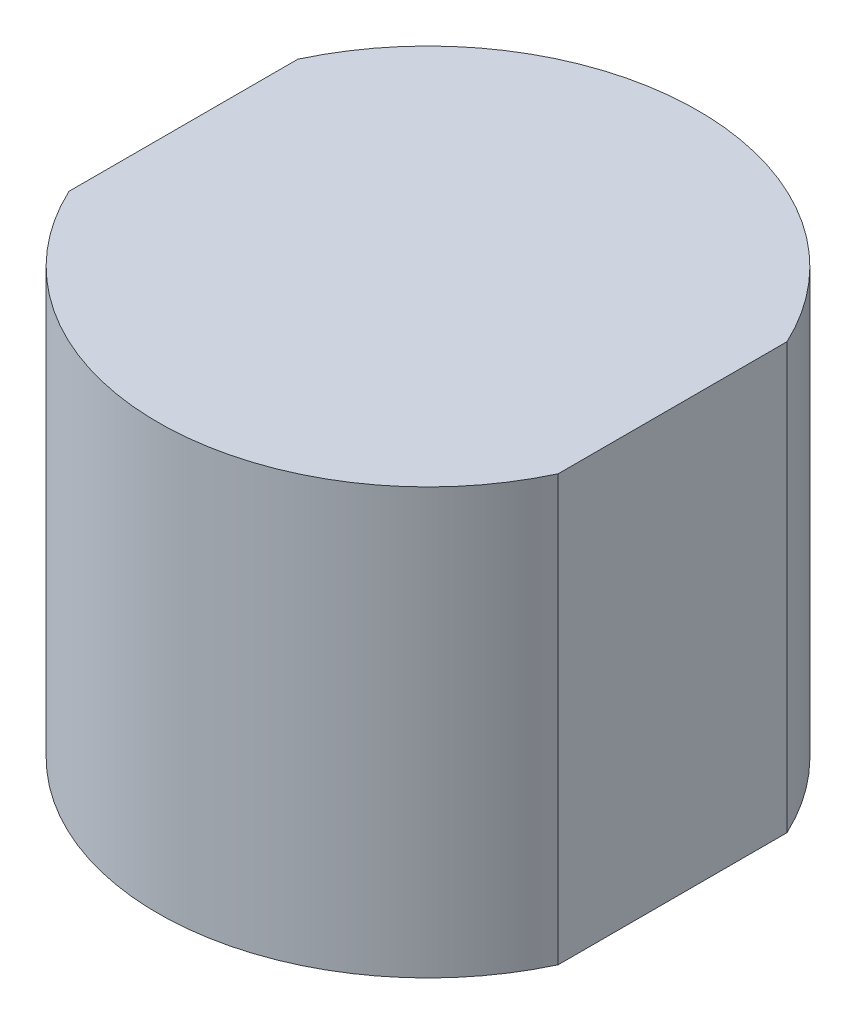
ISO-10303-21;
HEADER;
FILE_DESCRIPTION(('STEP AP214'),'2;1');
FILE_NAME('part.step','',(''),(''),'','','');
FILE_SCHEMA(('AUTOMOTIVE_DESIGN { 1 0 10303 214 1 1 1 1 }'));
ENDSEC;
DATA;
#1=APPLICATION_CONTEXT('core data for automotive mechanical design processes');
#2=APPLICATION_PROTOCOL_DEFINITION('international standard','automotive_design',2000,#1);
#3=PRODUCT_CONTEXT('',#1,'mechanical');
#4=PRODUCT('Part','Part','',(#3));
#5=PRODUCT_RELATED_PRODUCT_CATEGORY('part','',(#4));
#6=PRODUCT_DEFINITION_FORMATION('','',#4);
#7=PRODUCT_DEFINITION_CONTEXT('part definition',#1,'design');
#8=PRODUCT_DEFINITION('design','',#6,#7);
#9=PRODUCT_DEFINITION_SHAPE('','',#8);
#10=(LENGTH_UNIT() NAMED_UNIT(*) SI_UNIT(.MILLI.,.METRE.));
#11=(NAMED_UNIT(*) PLANE_ANGLE_UNIT() SI_UNIT($,.RADIAN.));
#12=(NAMED_UNIT(*) SI_UNIT($,.STERADIAN.) SOLID_ANGLE_UNIT());
#13=UNCERTAINTY_MEASURE_WITH_UNIT(LENGTH_MEASURE(1.E-05),#10,'distance_accuracy_value','');
#14=(GEOMETRIC_REPRESENTATION_CONTEXT(3) GLOBAL_UNCERTAINTY_ASSIGNED_CONTEXT((#13)) GLOBAL_UNIT_ASSIGNED_CONTEXT((#10,
#11,#12)) REPRESENTATION_CONTEXT('',''));
#15=CARTESIAN_POINT('',(0.,0.,0.));
#16=DIRECTION('',(0.,0.,1.));
#17=DIRECTION('',(1.,0.,0.));
#18=AXIS2_PLACEMENT_3D('',#15,#16,#17);
#19=CARTESIAN_POINT('',(5.7520778854254,10.,0.));
#20=DIRECTION('',(-1.,0.,0.));
#21=DIRECTION('',(0.,0.,1.));
#22=AXIS2_PLACEMENT_3D('',#19,#20,#21);
#23=PLANE('',#22);
#24=DIRECTION('',(0.,0.,-1.));
#25=VECTOR('',#24,1.);
#26=CARTESIAN_POINT('',(5.7520778854254,0.,0.));
#27=LINE('',#26,#25);
#28=CARTESIAN_POINT('',(5.7520778854254,0.,2.69));
#29=VERTEX_POINT('',#28);
#30=CARTESIAN_POINT('',(5.7520778854254,0.,-2.69));
#31=VERTEX_POINT('',#30);
#32=EDGE_CURVE('E107',#29,#31,#27,.T.);
#33=ORIENTED_EDGE('',*,*,#32,.T.);
#34=DIRECTION('',(0.,-1.,0.));
#35=VECTOR('',#34,1.);
#36=CARTESIAN_POINT('',(5.7520778854254,10.,-2.69));
#37=LINE('',#36,#35);
#38=CARTESIAN_POINT('',(5.7520778854254,10.,-2.69));
#39=VERTEX_POINT('',#38);
#40=EDGE_CURVE('E11',#39,#31,#37,.T.);
#41=ORIENTED_EDGE('',*,*,#40,.F.);
#42=DIRECTION('',(0.,0.,-1.));
#43=VECTOR('',#42,1.);
#44=CARTESIAN_POINT('',(5.7520778854254,10.,0.));
#45=LINE('',#44,#43);
#46=CARTESIAN_POINT('',(5.7520778854254,10.,2.69));
#47=VERTEX_POINT('',#46);
#48=EDGE_CURVE('E89',#47,#39,#45,.T.);
#49=ORIENTED_EDGE('',*,*,#48,.F.);
#50=DIRECTION('',(0.,-1.,0.));
#51=VECTOR('',#50,1.);
#52=CARTESIAN_POINT('',(5.7520778854254,10.,2.69));
#53=LINE('',#52,#51);
#54=EDGE_CURVE('E104',#47,#29,#53,.T.);
#55=ORIENTED_EDGE('',*,*,#54,.T.);
#56=EDGE_LOOP('',(#33,#41,#49,#55));
#57=FACE_BOUND('',#56,.T.);
#58=ADVANCED_FACE('F41',(#57),#23,.F.);
#59=CARTESIAN_POINT('',(0.,10.,0.));
#60=DIRECTION('',(0.,-1.,0.));
#61=DIRECTION('',(0.,0.,-1.));
#62=AXIS2_PLACEMENT_3D('',#59,#60,#61);
#63=CYLINDRICAL_SURFACE('',#62,6.35);
#64=CARTESIAN_POINT('',(0.,0.,0.));
#65=DIRECTION('',(0.,1.,0.));
#66=DIRECTION('',(0.,0.,1.));
#67=AXIS2_PLACEMENT_3D('',#64,#65,#66);
#68=CIRCLE('',#67,6.35);
#69=CARTESIAN_POINT('',(-5.7520778854254,0.,-2.69));
#70=VERTEX_POINT('',#69);
#71=EDGE_CURVE('E95',#31,#70,#68,.T.);
#72=ORIENTED_EDGE('',*,*,#71,.T.);
#73=DIRECTION('',(0.,-1.,0.));
#74=VECTOR('',#73,1.);
#75=CARTESIAN_POINT('',(-5.7520778854254,10.,-2.69));
#76=LINE('',#75,#74);
#77=CARTESIAN_POINT('',(-5.7520778854254,10.,-2.69));
#78=VERTEX_POINT('',#77);
#79=EDGE_CURVE('E50',#78,#70,#76,.T.);
#80=ORIENTED_EDGE('',*,*,#79,.F.);
#81=CARTESIAN_POINT('',(0.,10.,0.));
#82=DIRECTION('',(0.,1.,0.));
#83=DIRECTION('',(0.,0.,1.));
#84=AXIS2_PLACEMENT_3D('',#81,#82,#83);
#85=CIRCLE('',#84,6.35);
#86=EDGE_CURVE('E84',#39,#78,#85,.T.);
#87=ORIENTED_EDGE('',*,*,#86,.F.);
#88=ORIENTED_EDGE('',*,*,#40,.T.);
#89=EDGE_LOOP('',(#72,#80,#87,#88));
#90=FACE_BOUND('',#89,.T.);
#91=ADVANCED_FACE('F94',(#90),#63,.T.);
#92=CARTESIAN_POINT('',(-5.7520778854254,10.,0.));
#93=DIRECTION('',(-1.,0.,0.));
#94=DIRECTION('',(0.,0.,1.));
#95=AXIS2_PLACEMENT_3D('',#92,#93,#94);
#96=PLANE('',#95);
#97=DIRECTION('',(0.,0.,-1.));
#98=VECTOR('',#97,1.);
#99=CARTESIAN_POINT('',(-5.7520778854254,0.,0.));
#100=LINE('',#99,#98);
#101=CARTESIAN_POINT('',(-5.7520778854254,0.,2.69));
#102=VERTEX_POINT('',#101);
#103=EDGE_CURVE('E113',#102,#70,#100,.T.);
#104=ORIENTED_EDGE('',*,*,#103,.F.);
#105=DIRECTION('',(0.,-1.,0.));
#106=VECTOR('',#105,1.);
#107=CARTESIAN_POINT('',(-5.7520778854254,10.,2.69));
#108=LINE('',#107,#106);
#109=CARTESIAN_POINT('',(-5.7520778854254,10.,2.69));
#110=VERTEX_POINT('',#109);
#111=EDGE_CURVE('E74',#110,#102,#108,.T.);
#112=ORIENTED_EDGE('',*,*,#111,.F.);
#113=DIRECTION('',(0.,0.,-1.));
#114=VECTOR('',#113,1.);
#115=CARTESIAN_POINT('',(-5.7520778854254,10.,0.));
#116=LINE('',#115,#114);
#117=EDGE_CURVE('E87',#110,#78,#116,.T.);
#118=ORIENTED_EDGE('',*,*,#117,.T.);
#119=ORIENTED_EDGE('',*,*,#79,.T.);
#120=EDGE_LOOP('',(#104,#112,#118,#119));
#121=FACE_BOUND('',#120,.T.);
#122=ADVANCED_FACE('F100',(#121),#96,.T.);
#123=EDGE_CURVE('E77',#102,#29,#68,.T.);
#124=ORIENTED_EDGE('',*,*,#123,.T.);
#125=ORIENTED_EDGE('',*,*,#54,.F.);
#126=EDGE_CURVE('E58',#110,#47,#85,.T.);
#127=ORIENTED_EDGE('',*,*,#126,.F.);
#128=ORIENTED_EDGE('',*,*,#111,.T.);
#129=EDGE_LOOP('',(#124,#125,#127,#128));
#130=FACE_BOUND('',#129,.T.);
#131=ADVANCED_FACE('F130',(#130),#63,.T.);
#132=CARTESIAN_POINT('',(0.,10.,0.));
#133=DIRECTION('',(0.,1.,0.));
#134=DIRECTION('',(0.,0.,1.));
#135=AXIS2_PLACEMENT_3D('',#132,#133,#134);
#136=PLANE('',#135);
#137=ORIENTED_EDGE('',*,*,#48,.T.);
#138=ORIENTED_EDGE('',*,*,#86,.T.);
#139=ORIENTED_EDGE('',*,*,#117,.F.);
#140=ORIENTED_EDGE('',*,*,#126,.T.);
#141=EDGE_LOOP('',(#137,#138,#139,#140));
#142=FACE_BOUND('',#141,.T.);
#143=ADVANCED_FACE('F85',(#142),#136,.T.);
#144=CARTESIAN_POINT('',(0.,0.,0.));
#145=DIRECTION('',(0.,1.,0.));
#146=DIRECTION('',(0.,0.,1.));
#147=AXIS2_PLACEMENT_3D('',#144,#145,#146);
#148=PLANE('',#147);
#149=ORIENTED_EDGE('',*,*,#32,.F.);
#150=ORIENTED_EDGE('',*,*,#123,.F.);
#151=ORIENTED_EDGE('',*,*,#103,.T.);
#152=ORIENTED_EDGE('',*,*,#71,.F.);
#153=EDGE_LOOP('',(#149,#150,#151,#152));
#154=FACE_BOUND('',#153,.T.);
#155=ADVANCED_FACE('F122',(#154),#148,.F.);
#156=CLOSED_SHELL('',(#58,#91,#122,#131,#143,#155));
#157=MANIFOLD_SOLID_BREP('B2',#156);
#158=ADVANCED_BREP_SHAPE_REPRESENTATION('',(#18,#157),#14);
#159=SHAPE_DEFINITION_REPRESENTATION(#9,#158);
ENDSEC;
END-ISO-10303-21;
